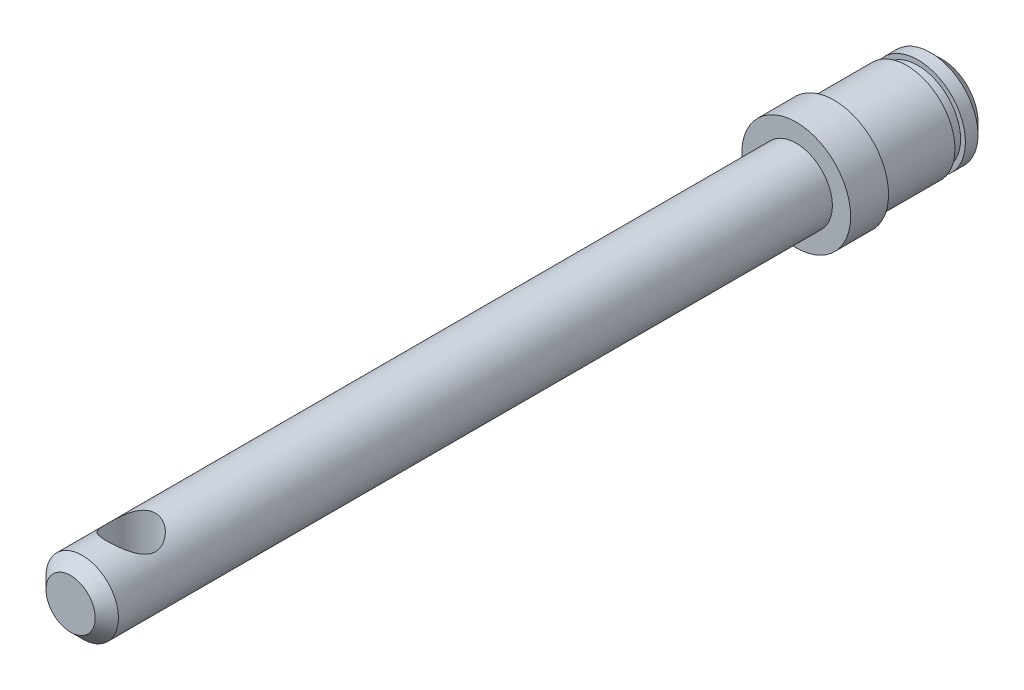
ISO-10303-21;
HEADER;
FILE_DESCRIPTION(('STEP AP214'),'2;1');
FILE_NAME('part.step','',(''),(''),'','','');
FILE_SCHEMA(('AUTOMOTIVE_DESIGN { 1 0 10303 214 1 1 1 1 }'));
ENDSEC;
DATA;
#1=APPLICATION_CONTEXT('core data for automotive mechanical design processes');
#2=APPLICATION_PROTOCOL_DEFINITION('international standard','automotive_design',2000,#1);
#3=PRODUCT_CONTEXT('',#1,'mechanical');
#4=PRODUCT('Part','Part','',(#3));
#5=PRODUCT_RELATED_PRODUCT_CATEGORY('part','',(#4));
#6=PRODUCT_DEFINITION_FORMATION('','',#4);
#7=PRODUCT_DEFINITION_CONTEXT('part definition',#1,'design');
#8=PRODUCT_DEFINITION('design','',#6,#7);
#9=PRODUCT_DEFINITION_SHAPE('','',#8);
#10=(LENGTH_UNIT() NAMED_UNIT(*) SI_UNIT(.MILLI.,.METRE.));
#11=(NAMED_UNIT(*) PLANE_ANGLE_UNIT() SI_UNIT($,.RADIAN.));
#12=(NAMED_UNIT(*) SI_UNIT($,.STERADIAN.) SOLID_ANGLE_UNIT());
#13=UNCERTAINTY_MEASURE_WITH_UNIT(LENGTH_MEASURE(1.E-05),#10,'distance_accuracy_value','');
#14=(GEOMETRIC_REPRESENTATION_CONTEXT(3) GLOBAL_UNCERTAINTY_ASSIGNED_CONTEXT((#13)) GLOBAL_UNIT_ASSIGNED_CONTEXT((#10,
#11,#12)) REPRESENTATION_CONTEXT('',''));
#15=CARTESIAN_POINT('',(0.,0.,0.));
#16=DIRECTION('',(0.,0.,1.));
#17=DIRECTION('',(1.,0.,0.));
#18=AXIS2_PLACEMENT_3D('',#15,#16,#17);
#19=CARTESIAN_POINT('',(0.,0.,-9.5758));
#20=DIRECTION('',(0.,0.,-1.));
#21=DIRECTION('',(-1.,0.,0.));
#22=AXIS2_PLACEMENT_3D('',#19,#20,#21);
#23=PLANE('',#22);
#24=CARTESIAN_POINT('',(0.,0.,-9.57579999993641));
#25=DIRECTION('',(0.,0.,1.));
#26=DIRECTION('',(1.,0.,0.));
#27=AXIS2_PLACEMENT_3D('',#24,#25,#26);
#28=CIRCLE('',#27,2.3494999999798);
#29=CARTESIAN_POINT('',(2.3494999999798,0.,-9.57579999993641));
#30=VERTEX_POINT('',#29);
#31=EDGE_CURVE('E18',#30,#30,#28,.T.);
#32=ORIENTED_EDGE('',*,*,#31,.F.);
#33=EDGE_LOOP('',(#32));
#34=FACE_BOUND('',#33,.T.);
#35=ADVANCED_FACE('F15',(#34),#23,.T.);
#36=CARTESIAN_POINT('',(0.,0.,-8.81380000009813));
#37=DIRECTION('',(0.,0.,1.));
#38=DIRECTION('',(1.,0.,0.));
#39=AXIS2_PLACEMENT_3D('',#36,#37,#38);
#40=CONICAL_SURFACE('',#39,3.11149999987492,0.785398163434747);
#41=ORIENTED_EDGE('',*,*,#31,.T.);
#42=EDGE_LOOP('',(#41));
#43=FACE_BOUND('',#42,.T.);
#44=CARTESIAN_POINT('',(0.,0.,-8.8138));
#45=DIRECTION('',(0.,0.,1.));
#46=DIRECTION('',(1.,0.,0.));
#47=AXIS2_PLACEMENT_3D('',#44,#45,#46);
#48=CIRCLE('',#47,3.1115);
#49=CARTESIAN_POINT('',(3.1115,0.,-8.8138));
#50=VERTEX_POINT('',#49);
#51=EDGE_CURVE('E35',#50,#50,#48,.T.);
#52=ORIENTED_EDGE('',*,*,#51,.F.);
#53=EDGE_LOOP('',(#52));
#54=FACE_BOUND('',#53,.T.);
#55=ADVANCED_FACE('F82',(#43,#54),#40,.T.);
#56=CARTESIAN_POINT('',(0.,0.,-9.5758));
#57=DIRECTION('',(0.,0.,1.));
#58=DIRECTION('',(1.,0.,0.));
#59=AXIS2_PLACEMENT_3D('',#56,#57,#58);
#60=CYLINDRICAL_SURFACE('',#59,3.1115);
#61=ORIENTED_EDGE('',*,*,#51,.T.);
#62=EDGE_LOOP('',(#61));
#63=FACE_BOUND('',#62,.T.);
#64=CARTESIAN_POINT('',(0.,0.,-7.9883));
#65=DIRECTION('',(0.,0.,1.));
#66=DIRECTION('',(1.,0.,0.));
#67=AXIS2_PLACEMENT_3D('',#64,#65,#66);
#68=CIRCLE('',#67,3.1115);
#69=CARTESIAN_POINT('',(3.1115,0.,-7.9883));
#70=VERTEX_POINT('',#69);
#71=EDGE_CURVE('E72',#70,#70,#68,.F.);
#72=ORIENTED_EDGE('',*,*,#71,.T.);
#73=EDGE_LOOP('',(#72));
#74=FACE_BOUND('',#73,.T.);
#75=ADVANCED_FACE('F90',(#63,#74),#60,.T.);
#76=CARTESIAN_POINT('',(0.,0.,-7.9883));
#77=DIRECTION('',(0.,0.,-1.));
#78=DIRECTION('',(-1.,0.,0.));
#79=AXIS2_PLACEMENT_3D('',#76,#77,#78);
#80=PLANE('',#79);
#81=CARTESIAN_POINT('',(0.,0.,-7.9883));
#82=DIRECTION('',(0.,0.,1.));
#83=DIRECTION('',(1.,0.,0.));
#84=AXIS2_PLACEMENT_3D('',#81,#82,#83);
#85=CIRCLE('',#84,2.794);
#86=CARTESIAN_POINT('',(2.794,0.,-7.9883));
#87=VERTEX_POINT('',#86);
#88=EDGE_CURVE('E70',#87,#87,#85,.T.);
#89=ORIENTED_EDGE('',*,*,#88,.F.);
#90=EDGE_LOOP('',(#89));
#91=FACE_BOUND('',#90,.T.);
#92=ORIENTED_EDGE('',*,*,#71,.F.);
#93=EDGE_LOOP('',(#92));
#94=FACE_BOUND('',#93,.T.);
#95=ADVANCED_FACE('F94',(#91,#94),#80,.F.);
#96=CARTESIAN_POINT('',(0.,0.,-7.9883));
#97=DIRECTION('',(0.,0.,1.));
#98=DIRECTION('',(1.,0.,0.));
#99=AXIS2_PLACEMENT_3D('',#96,#97,#98);
#100=CYLINDRICAL_SURFACE('',#99,2.794);
#101=CARTESIAN_POINT('',(0.,0.,-7.2517));
#102=DIRECTION('',(0.,0.,1.));
#103=DIRECTION('',(1.,0.,0.));
#104=AXIS2_PLACEMENT_3D('',#101,#102,#103);
#105=CIRCLE('',#104,2.794);
#106=CARTESIAN_POINT('',(2.794,0.,-7.2517));
#107=VERTEX_POINT('',#106);
#108=EDGE_CURVE('E67',#107,#107,#105,.T.);
#109=ORIENTED_EDGE('',*,*,#108,.F.);
#110=EDGE_LOOP('',(#109));
#111=FACE_BOUND('',#110,.T.);
#112=ORIENTED_EDGE('',*,*,#88,.T.);
#113=EDGE_LOOP('',(#112));
#114=FACE_BOUND('',#113,.T.);
#115=ADVANCED_FACE('F99',(#111,#114),#100,.T.);
#116=CARTESIAN_POINT('',(0.,0.,-7.2517));
#117=DIRECTION('',(0.,0.,-1.));
#118=DIRECTION('',(-1.,0.,0.));
#119=AXIS2_PLACEMENT_3D('',#116,#117,#118);
#120=PLANE('',#119);
#121=ORIENTED_EDGE('',*,*,#108,.T.);
#122=EDGE_LOOP('',(#121));
#123=FACE_BOUND('',#122,.T.);
#124=CARTESIAN_POINT('',(0.,0.,-7.2517));
#125=DIRECTION('',(0.,0.,1.));
#126=DIRECTION('',(1.,0.,0.));
#127=AXIS2_PLACEMENT_3D('',#124,#125,#126);
#128=CIRCLE('',#127,3.1623);
#129=CARTESIAN_POINT('',(3.1623,0.,-7.2517));
#130=VERTEX_POINT('',#129);
#131=EDGE_CURVE('E64',#130,#130,#128,.T.);
#132=ORIENTED_EDGE('',*,*,#131,.F.);
#133=EDGE_LOOP('',(#132));
#134=FACE_BOUND('',#133,.T.);
#135=ADVANCED_FACE('F103',(#123,#134),#120,.T.);
#136=CARTESIAN_POINT('',(0.,0.,-7.2517));
#137=DIRECTION('',(0.,0.,1.));
#138=DIRECTION('',(1.,0.,0.));
#139=AXIS2_PLACEMENT_3D('',#136,#137,#138);
#140=CYLINDRICAL_SURFACE('',#139,3.1623);
#141=ORIENTED_EDGE('',*,*,#131,.T.);
#142=EDGE_LOOP('',(#141));
#143=FACE_BOUND('',#142,.T.);
#144=CARTESIAN_POINT('',(0.,0.,-2.4892));
#145=DIRECTION('',(0.,0.,1.));
#146=DIRECTION('',(1.,0.,0.));
#147=AXIS2_PLACEMENT_3D('',#144,#145,#146);
#148=CIRCLE('',#147,3.1623);
#149=CARTESIAN_POINT('',(3.1623,0.,-2.4892));
#150=VERTEX_POINT('',#149);
#151=EDGE_CURVE('E61',#150,#150,#148,.F.);
#152=ORIENTED_EDGE('',*,*,#151,.T.);
#153=EDGE_LOOP('',(#152));
#154=FACE_BOUND('',#153,.T.);
#155=ADVANCED_FACE('F107',(#143,#154),#140,.T.);
#156=CARTESIAN_POINT('',(0.,0.,-2.4892));
#157=DIRECTION('',(0.,0.,1.));
#158=DIRECTION('',(1.,0.,0.));
#159=AXIS2_PLACEMENT_3D('',#156,#157,#158);
#160=PLANE('',#159);
#161=ORIENTED_EDGE('',*,*,#151,.F.);
#162=EDGE_LOOP('',(#161));
#163=FACE_BOUND('',#162,.T.);
#164=CARTESIAN_POINT('',(0.,0.,-2.4892));
#165=DIRECTION('',(0.,0.,1.));
#166=DIRECTION('',(1.,0.,0.));
#167=AXIS2_PLACEMENT_3D('',#164,#165,#166);
#168=CIRCLE('',#167,3.571875);
#169=CARTESIAN_POINT('',(3.571875,0.,-2.4892));
#170=VERTEX_POINT('',#169);
#171=EDGE_CURVE('E58',#170,#170,#168,.T.);
#172=ORIENTED_EDGE('',*,*,#171,.F.);
#173=EDGE_LOOP('',(#172));
#174=FACE_BOUND('',#173,.T.);
#175=ADVANCED_FACE('F111',(#163,#174),#160,.F.);
#176=CARTESIAN_POINT('',(0.,0.,47.5742));
#177=DIRECTION('',(0.,0.,1.));
#178=DIRECTION('',(1.,0.,0.));
#179=AXIS2_PLACEMENT_3D('',#176,#177,#178);
#180=PLANE('',#179);
#181=CARTESIAN_POINT('',(0.,0.,47.5741999999855));
#182=DIRECTION('',(0.,0.,-1.));
#183=DIRECTION('',(-1.,0.,0.));
#184=AXIS2_PLACEMENT_3D('',#181,#182,#183);
#185=CIRCLE('',#184,1.61289999999781);
#186=CARTESIAN_POINT('',(-1.61289999999781,0.,47.5741999999855));
#187=VERTEX_POINT('',#186);
#188=EDGE_CURVE('E55',#187,#187,#185,.T.);
#189=ORIENTED_EDGE('',*,*,#188,.F.);
#190=EDGE_LOOP('',(#189));
#191=FACE_BOUND('',#190,.T.);
#192=ADVANCED_FACE('F115',(#191),#180,.T.);
#193=CARTESIAN_POINT('',(0.,0.,-2.4892));
#194=DIRECTION('',(0.,0.,1.));
#195=DIRECTION('',(1.,0.,0.));
#196=AXIS2_PLACEMENT_3D('',#193,#194,#195);
#197=CYLINDRICAL_SURFACE('',#196,3.571875);
#198=ORIENTED_EDGE('',*,*,#171,.T.);
#199=EDGE_LOOP('',(#198));
#200=FACE_BOUND('',#199,.T.);
#201=CARTESIAN_POINT('',(0.,0.,0.));
#202=DIRECTION('',(0.,0.,1.));
#203=DIRECTION('',(1.,0.,0.));
#204=AXIS2_PLACEMENT_3D('',#201,#202,#203);
#205=CIRCLE('',#204,3.571875);
#206=CARTESIAN_POINT('',(3.571875,0.,0.));
#207=VERTEX_POINT('',#206);
#208=EDGE_CURVE('E52',#207,#207,#205,.T.);
#209=ORIENTED_EDGE('',*,*,#208,.F.);
#210=EDGE_LOOP('',(#209));
#211=FACE_BOUND('',#210,.T.);
#212=ADVANCED_FACE('F119',(#200,#211),#197,.T.);
#213=CARTESIAN_POINT('',(0.,0.,46.8121999999767));
#214=DIRECTION('',(0.,0.,-1.));
#215=DIRECTION('',(-1.,0.,0.));
#216=AXIS2_PLACEMENT_3D('',#213,#214,#215);
#217=CONICAL_SURFACE('',#216,2.37490000000662,0.785398163397448);
#218=ORIENTED_EDGE('',*,*,#188,.T.);
#219=EDGE_LOOP('',(#218));
#220=FACE_BOUND('',#219,.T.);
#221=CARTESIAN_POINT('',(0.,0.,46.8122));
#222=DIRECTION('',(0.,0.,-1.));
#223=DIRECTION('',(-1.,0.,0.));
#224=AXIS2_PLACEMENT_3D('',#221,#222,#223);
#225=CIRCLE('',#224,2.3749);
#226=CARTESIAN_POINT('',(-2.3749,0.,46.8122));
#227=VERTEX_POINT('',#226);
#228=EDGE_CURVE('E27',#227,#227,#225,.T.);
#229=ORIENTED_EDGE('',*,*,#228,.F.);
#230=EDGE_LOOP('',(#229));
#231=FACE_BOUND('',#230,.T.);
#232=ADVANCED_FACE('F123',(#220,#231),#217,.T.);
#233=CARTESIAN_POINT('',(0.,0.,0.));
#234=DIRECTION('',(0.,0.,1.));
#235=DIRECTION('',(1.,0.,0.));
#236=AXIS2_PLACEMENT_3D('',#233,#234,#235);
#237=PLANE('',#236);
#238=CARTESIAN_POINT('',(0.,0.,0.));
#239=DIRECTION('',(0.,0.,-1.));
#240=DIRECTION('',(-1.,0.,0.));
#241=AXIS2_PLACEMENT_3D('',#238,#239,#240);
#242=CIRCLE('',#241,2.3749);
#243=CARTESIAN_POINT('',(-2.3749,0.,0.));
#244=VERTEX_POINT('',#243);
#245=EDGE_CURVE('E22',#244,#244,#242,.F.);
#246=ORIENTED_EDGE('',*,*,#245,.F.);
#247=EDGE_LOOP('',(#246));
#248=FACE_BOUND('',#247,.T.);
#249=ORIENTED_EDGE('',*,*,#208,.T.);
#250=EDGE_LOOP('',(#249));
#251=FACE_BOUND('',#250,.T.);
#252=ADVANCED_FACE('F126',(#248,#251),#237,.T.);
#253=CARTESIAN_POINT('',(0.,-3.571875,43.60545));
#254=DIRECTION('',(0.,1.,0.));
#255=DIRECTION('',(0.,0.,1.));
#256=AXIS2_PLACEMENT_3D('',#253,#254,#255);
#257=CYLINDRICAL_SURFACE('',#256,1.5875);
#258=CARTESIAN_POINT('',(0.,2.3749,45.19295));
#259=CARTESIAN_POINT('',(-0.0796285021727966,2.37489427166207,45.1929439134093));
#260=CARTESIAN_POINT('',(-0.159333187346092,2.3708547437601,45.1869178453679));
#261=CARTESIAN_POINT('',(-0.316246788253907,2.35507625489168,45.1631617849446));
#262=CARTESIAN_POINT('',(-0.393451638249593,2.34332535323937,45.1454136412255));
#263=CARTESIAN_POINT('',(-0.542790518515763,2.31328830758023,45.0993083312295));
#264=CARTESIAN_POINT('',(-0.614948378456795,2.29503576257873,45.0710056736267));
#265=CARTESIAN_POINT('',(-0.753178545236462,2.25346165524091,45.0050040485006));
#266=CARTESIAN_POINT('',(-0.819251194999285,2.23014037879558,44.9673056109087));
#267=CARTESIAN_POINT('',(-0.949807131451189,2.17792784028168,44.8800881288627));
#268=CARTESIAN_POINT('',(-1.01367601133952,2.14873138397025,44.8298358883516));
#269=CARTESIAN_POINT('',(-1.13266066753279,2.0884656766868,44.7206931180195));
#270=CARTESIAN_POINT('',(-1.18776336726205,2.05739372150985,44.6617899306125));
#271=CARTESIAN_POINT('',(-1.29659427145063,1.99089626995362,44.5261680967343));
#272=CARTESIAN_POINT('',(-1.34871636553572,1.95556248733199,44.4481056626616));
#273=CARTESIAN_POINT('',(-1.43904349853149,1.89008374794265,44.2823403381314));
#274=CARTESIAN_POINT('',(-1.4772725865024,1.85992987284409,44.1946544520516));
#275=CARTESIAN_POINT('',(-1.52904517834333,1.81740283377534,44.0377472795276));
#276=CARTESIAN_POINT('',(-1.54653236351236,1.80240921282223,43.9705447171603));
#277=CARTESIAN_POINT('',(-1.57261168441343,1.77970474695812,43.8332848433952));
#278=CARTESIAN_POINT('',(-1.58121930044462,1.7719812296935,43.763232722255));
#279=CARTESIAN_POINT('',(-1.58899802612375,1.76501215254764,43.6218716388384));
#280=CARTESIAN_POINT('',(-1.58812985724121,1.76580188116326,43.5505586693621));
#281=CARTESIAN_POINT('',(-1.57692650593038,1.77581049841768,43.4092572197684));
#282=CARTESIAN_POINT('',(-1.56658327442516,1.7850365537139,43.3392699174096));
#283=CARTESIAN_POINT('',(-1.53778680769931,1.80988877384798,43.2056567626746));
#284=CARTESIAN_POINT('',(-1.51972103829905,1.82520699487101,43.1418863605764));
#285=CARTESIAN_POINT('',(-1.47635800673587,1.86045582345457,43.0182351850859));
#286=CARTESIAN_POINT('',(-1.45105836975688,1.88038794530891,42.9583556969829));
#287=CARTESIAN_POINT('',(-1.38804369169894,1.92751840139636,42.8311724358925));
#288=CARTESIAN_POINT('',(-1.34884877883874,1.95536954816995,42.7648460457442));
#289=CARTESIAN_POINT('',(-1.26169992826936,2.01270750683002,42.6389401049234));
#290=CARTESIAN_POINT('',(-1.21373539144903,2.04219626760565,42.5793688613398));
#291=CARTESIAN_POINT('',(-1.09822042057742,2.10697571698643,42.4553504562286));
#292=CARTESIAN_POINT('',(-1.02867941502371,2.14213147691545,42.3926663982129));
#293=CARTESIAN_POINT('',(-0.87829590652397,2.20804612806214,42.2797162875604));
#294=CARTESIAN_POINT('',(-0.797461070213304,2.23880797360637,42.2294418743602));
#295=CARTESIAN_POINT('',(-0.642794196366182,2.28740091649053,42.151857840345));
#296=CARTESIAN_POINT('',(-0.570673934887535,2.30658392602361,42.1219812810788));
#297=CARTESIAN_POINT('',(-0.421590346714549,2.33841465201831,42.0729550712348));
#298=CARTESIAN_POINT('',(-0.344638477425361,2.35107721947041,42.05378103609));
#299=CARTESIAN_POINT('',(-0.222529004084351,2.36486476954346,42.0329936390966));
#300=CARTESIAN_POINT('',(-0.178308116016056,2.36861511899109,42.0273651451537));
#301=CARTESIAN_POINT('',(-0.0893995612791168,2.37363462559172,42.0198411908061));
#302=CARTESIAN_POINT('',(-0.0447117904210668,2.37490321648955,42.0179465823498));
#303=CARTESIAN_POINT('',(0.0796285021727959,2.37489427166207,42.0179560865907));
#304=CARTESIAN_POINT('',(0.159333187346092,2.3708547437601,42.0239821546321));
#305=CARTESIAN_POINT('',(0.316246788253906,2.35507625489168,42.0477382150553));
#306=CARTESIAN_POINT('',(0.393451638249593,2.34332535323937,42.0654863587745));
#307=CARTESIAN_POINT('',(0.542790518515763,2.31328830758023,42.1115916687705));
#308=CARTESIAN_POINT('',(0.614948378456795,2.29503576257873,42.1398943263733));
#309=CARTESIAN_POINT('',(0.753178545236463,2.25346165524091,42.2058959514994));
#310=CARTESIAN_POINT('',(0.819251194999285,2.23014037879558,42.2435943890913));
#311=CARTESIAN_POINT('',(0.949807131451189,2.17792784028168,42.3308118711373));
#312=CARTESIAN_POINT('',(1.01367601133952,2.14873138397025,42.3810641116484));
#313=CARTESIAN_POINT('',(1.13266066753279,2.0884656766868,42.4902068819805));
#314=CARTESIAN_POINT('',(1.18776336726205,2.05739372150985,42.5491100693874));
#315=CARTESIAN_POINT('',(1.29659427145063,1.99089626995362,42.6847319032657));
#316=CARTESIAN_POINT('',(1.34871636553572,1.95556248733199,42.7627943373384));
#317=CARTESIAN_POINT('',(1.43904349853149,1.89008374794265,42.9285596618686));
#318=CARTESIAN_POINT('',(1.4772725865024,1.85992987284409,43.0162455479484));
#319=CARTESIAN_POINT('',(1.52904517834333,1.81740283377534,43.1731527204724));
#320=CARTESIAN_POINT('',(1.54653236351236,1.80240921282223,43.2403552828397));
#321=CARTESIAN_POINT('',(1.57261168441343,1.77970474695812,43.3776151566048));
#322=CARTESIAN_POINT('',(1.58121930044462,1.7719812296935,43.447667277745));
#323=CARTESIAN_POINT('',(1.58899802612375,1.76501215254764,43.5890283611616));
#324=CARTESIAN_POINT('',(1.58812985724121,1.76580188116326,43.6603413306379));
#325=CARTESIAN_POINT('',(1.57692650593038,1.77581049841768,43.8016427802316));
#326=CARTESIAN_POINT('',(1.56658327442517,1.7850365537139,43.8716300825904));
#327=CARTESIAN_POINT('',(1.53778680769931,1.80988877384798,44.0052432373254));
#328=CARTESIAN_POINT('',(1.51972103829905,1.825206994871,44.0690136394236));
#329=CARTESIAN_POINT('',(1.47635800673587,1.86045582345457,44.192664814914));
#330=CARTESIAN_POINT('',(1.45105836975689,1.88038794530891,44.2525443030171));
#331=CARTESIAN_POINT('',(1.38804369169894,1.92751840139636,44.3797275641075));
#332=CARTESIAN_POINT('',(1.34884877883874,1.95536954816995,44.4460539542558));
#333=CARTESIAN_POINT('',(1.26169992826936,2.01270750683002,44.5719598950766));
#334=CARTESIAN_POINT('',(1.21373539144903,2.04219626760564,44.6315311386602));
#335=CARTESIAN_POINT('',(1.09822042057742,2.10697571698643,44.7555495437714));
#336=CARTESIAN_POINT('',(1.02867941502371,2.14213147691544,44.8182336017871));
#337=CARTESIAN_POINT('',(0.87829590652398,2.20804612806214,44.9311837124396));
#338=CARTESIAN_POINT('',(0.797461070213316,2.23880797360636,44.9814581256398));
#339=CARTESIAN_POINT('',(0.642794196366197,2.28740091649053,45.059042159655));
#340=CARTESIAN_POINT('',(0.57067393488755,2.30658392602361,45.0889187189212));
#341=CARTESIAN_POINT('',(0.421590346714565,2.33841465201831,45.1379449287651));
#342=CARTESIAN_POINT('',(0.344638477425378,2.3510772194704,45.15711896391));
#343=CARTESIAN_POINT('',(0.222529004084365,2.36486476954346,45.1779063609034));
#344=CARTESIAN_POINT('',(0.178308116016067,2.36861511899109,45.1835348548463));
#345=CARTESIAN_POINT('',(0.0893995612791212,2.37363462559172,45.1910588091939));
#346=CARTESIAN_POINT('',(0.0447117904210687,2.37490321648955,45.1929534176502));
#347=CARTESIAN_POINT('',(0.,2.3749,45.19295));
#348=B_SPLINE_CURVE_WITH_KNOTS('',3,(#258,#259,#260,#261,#262,#263,#264,#265,#266,#267,#268,
#269,#270,#271,#272,#273,#274,#275,#276,#277,#278,#279,#280,#281,#282,#283,#284,#285,#286,#287,
#288,#289,#290,#291,#292,#293,#294,#295,#296,#297,#298,#299,#300,#301,#302,#303,#304,#305,#306,
#307,#308,#309,#310,#311,#312,#313,#314,#315,#316,#317,#318,#319,#320,#321,#322,#323,#324,#325,
#326,#327,#328,#329,#330,#331,#332,#333,#334,#335,#336,#337,#338,#339,#340,#341,#342,#343,#344,
#345,#346,#347),.UNSPECIFIED.,.T.,.F.,(4,2,2,2,2,2,2,2,2,2,2,2,2,2,2,2,2,2,2,2,2,2,2,2,2,2,2,2,
2,2,2,2,2,2,2,2,2,2,2,2,2,2,2,2,4),(0.,0.238700395852421,0.477771282535445,0.71562421428543,
0.95346373392742,1.21155549797826,1.47002872073382,1.76952408912618,2.06849852769238,
2.28077891750231,2.49268859719911,2.70547700634111,2.9184463472867,3.12179507761272,
3.32521064236503,3.57012288877609,3.815333120713,4.1139409115089,4.41234697329097,
4.65252034508975,4.89214425005817,5.02614510978654,5.16017654051243,5.39887693636485,
5.63794782304788,5.87580075479786,6.11364027443985,6.37173203849069,6.63020526124625,
6.92970062963861,7.22867506820481,7.44095545801474,7.65286513771153,7.86565354685354,
8.07862288779913,8.28197161812515,8.48538718287745,8.73029942928851,8.97550966122542,
9.27411745202132,9.57252351380338,9.81269688560216,10.0523207905706,10.186321650299,
10.3203530810249),.UNSPECIFIED.);
#349=CARTESIAN_POINT('',(0.,2.3749,45.19295));
#350=VERTEX_POINT('',#349);
#351=EDGE_CURVE('E46',#350,#350,#348,.T.);
#352=ORIENTED_EDGE('',*,*,#351,.F.);
#353=EDGE_LOOP('',(#352));
#354=FACE_BOUND('',#353,.T.);
#355=CARTESIAN_POINT('',(0.,-2.3749,45.19295));
#356=CARTESIAN_POINT('',(0.079628502172797,-2.37489427166208,45.1929439134093));
#357=CARTESIAN_POINT('',(0.159333187346093,-2.3708547437601,45.1869178453679));
#358=CARTESIAN_POINT('',(0.316246788253907,-2.35507625489168,45.1631617849446));
#359=CARTESIAN_POINT('',(0.393451638249594,-2.34332535323937,45.1454136412255));
#360=CARTESIAN_POINT('',(0.542790518515763,-2.31328830758023,45.0993083312295));
#361=CARTESIAN_POINT('',(0.614948378456796,-2.29503576257873,45.0710056736267));
#362=CARTESIAN_POINT('',(0.753178545236462,-2.25346165524091,45.0050040485006));
#363=CARTESIAN_POINT('',(0.819251194999285,-2.23014037879558,44.9673056109087));
#364=CARTESIAN_POINT('',(0.949807131451189,-2.17792784028168,44.8800881288627));
#365=CARTESIAN_POINT('',(1.01367601133952,-2.14873138397025,44.8298358883516));
#366=CARTESIAN_POINT('',(1.13266066753279,-2.0884656766868,44.7206931180195));
#367=CARTESIAN_POINT('',(1.18776336726205,-2.05739372150985,44.6617899306125));
#368=CARTESIAN_POINT('',(1.29659427145063,-1.99089626995362,44.5261680967343));
#369=CARTESIAN_POINT('',(1.34871636553572,-1.95556248733199,44.4481056626616));
#370=CARTESIAN_POINT('',(1.43904349853149,-1.89008374794265,44.2823403381314));
#371=CARTESIAN_POINT('',(1.4772725865024,-1.85992987284409,44.1946544520516));
#372=CARTESIAN_POINT('',(1.52904517834333,-1.81740283377534,44.0377472795276));
#373=CARTESIAN_POINT('',(1.54653236351237,-1.80240921282223,43.9705447171602));
#374=CARTESIAN_POINT('',(1.57261168441344,-1.77970474695812,43.8332848433952));
#375=CARTESIAN_POINT('',(1.58121930044462,-1.7719812296935,43.763232722255));
#376=CARTESIAN_POINT('',(1.58899802612375,-1.76501215254764,43.6218716388384));
#377=CARTESIAN_POINT('',(1.58812985724121,-1.76580188116326,43.5505586693621));
#378=CARTESIAN_POINT('',(1.57692650593038,-1.77581049841768,43.4092572197684));
#379=CARTESIAN_POINT('',(1.56658327442516,-1.7850365537139,43.3392699174096));
#380=CARTESIAN_POINT('',(1.53778680769931,-1.80988877384798,43.2056567626746));
#381=CARTESIAN_POINT('',(1.51972103829905,-1.82520699487101,43.1418863605764));
#382=CARTESIAN_POINT('',(1.47635800673587,-1.86045582345457,43.0182351850859));
#383=CARTESIAN_POINT('',(1.45105836975688,-1.88038794530891,42.9583556969829));
#384=CARTESIAN_POINT('',(1.38804369169894,-1.92751840139636,42.8311724358925));
#385=CARTESIAN_POINT('',(1.34884877883874,-1.95536954816995,42.7648460457442));
#386=CARTESIAN_POINT('',(1.26169992826936,-2.01270750683002,42.6389401049234));
#387=CARTESIAN_POINT('',(1.21373539144903,-2.04219626760565,42.5793688613398));
#388=CARTESIAN_POINT('',(1.09822042057742,-2.10697571698643,42.4553504562286));
#389=CARTESIAN_POINT('',(1.0286794150237,-2.14213147691545,42.3926663982129));
#390=CARTESIAN_POINT('',(0.878295906523966,-2.20804612806214,42.2797162875604));
#391=CARTESIAN_POINT('',(0.797461070213302,-2.23880797360637,42.2294418743602));
#392=CARTESIAN_POINT('',(0.642794196366183,-2.28740091649053,42.151857840345));
#393=CARTESIAN_POINT('',(0.570673934887537,-2.30658392602361,42.1219812810788));
#394=CARTESIAN_POINT('',(0.421590346714551,-2.33841465201831,42.0729550712348));
#395=CARTESIAN_POINT('',(0.344638477425362,-2.35107721947041,42.05378103609));
#396=CARTESIAN_POINT('',(0.22252900408435,-2.36486476954346,42.0329936390966));
#397=CARTESIAN_POINT('',(0.178308116016056,-2.36861511899109,42.0273651451537));
#398=CARTESIAN_POINT('',(0.0893995612791169,-2.37363462559172,42.0198411908061));
#399=CARTESIAN_POINT('',(0.0447117904210671,-2.37490321648955,42.0179465823498));
#400=CARTESIAN_POINT('',(-0.0796285021727957,-2.37489427166208,42.0179560865907));
#401=CARTESIAN_POINT('',(-0.159333187346092,-2.3708547437601,42.0239821546321));
#402=CARTESIAN_POINT('',(-0.316246788253906,-2.35507625489168,42.0477382150553));
#403=CARTESIAN_POINT('',(-0.393451638249593,-2.34332535323937,42.0654863587745));
#404=CARTESIAN_POINT('',(-0.542790518515762,-2.31328830758023,42.1115916687705));
#405=CARTESIAN_POINT('',(-0.614948378456795,-2.29503576257873,42.1398943263733));
#406=CARTESIAN_POINT('',(-0.753178545236462,-2.25346165524091,42.2058959514994));
#407=CARTESIAN_POINT('',(-0.819251194999284,-2.23014037879558,42.2435943890913));
#408=CARTESIAN_POINT('',(-0.949807131451189,-2.17792784028168,42.3308118711373));
#409=CARTESIAN_POINT('',(-1.01367601133952,-2.14873138397025,42.3810641116484));
#410=CARTESIAN_POINT('',(-1.13266066753279,-2.0884656766868,42.4902068819805));
#411=CARTESIAN_POINT('',(-1.18776336726205,-2.05739372150985,42.5491100693874));
#412=CARTESIAN_POINT('',(-1.29659427145063,-1.99089626995362,42.6847319032657));
#413=CARTESIAN_POINT('',(-1.34871636553572,-1.95556248733199,42.7627943373384));
#414=CARTESIAN_POINT('',(-1.43904349853149,-1.89008374794265,42.9285596618686));
#415=CARTESIAN_POINT('',(-1.4772725865024,-1.85992987284409,43.0162455479484));
#416=CARTESIAN_POINT('',(-1.52904517834333,-1.81740283377534,43.1731527204724));
#417=CARTESIAN_POINT('',(-1.54653236351237,-1.80240921282223,43.2403552828398));
#418=CARTESIAN_POINT('',(-1.57261168441344,-1.77970474695812,43.3776151566048));
#419=CARTESIAN_POINT('',(-1.58121930044462,-1.7719812296935,43.447667277745));
#420=CARTESIAN_POINT('',(-1.58899802612375,-1.76501215254764,43.5890283611616));
#421=CARTESIAN_POINT('',(-1.58812985724121,-1.76580188116326,43.6603413306379));
#422=CARTESIAN_POINT('',(-1.57692650593038,-1.77581049841768,43.8016427802316));
#423=CARTESIAN_POINT('',(-1.56658327442516,-1.7850365537139,43.8716300825904));
#424=CARTESIAN_POINT('',(-1.53778680769931,-1.80988877384798,44.0052432373254));
#425=CARTESIAN_POINT('',(-1.51972103829905,-1.82520699487101,44.0690136394236));
#426=CARTESIAN_POINT('',(-1.47635800673587,-1.86045582345457,44.192664814914));
#427=CARTESIAN_POINT('',(-1.45105836975688,-1.88038794530891,44.2525443030171));
#428=CARTESIAN_POINT('',(-1.38804369169894,-1.92751840139636,44.3797275641075));
#429=CARTESIAN_POINT('',(-1.34884877883874,-1.95536954816995,44.4460539542558));
#430=CARTESIAN_POINT('',(-1.26169992826936,-2.01270750683002,44.5719598950766));
#431=CARTESIAN_POINT('',(-1.21373539144903,-2.04219626760565,44.6315311386602));
#432=CARTESIAN_POINT('',(-1.09822042057742,-2.10697571698643,44.7555495437714));
#433=CARTESIAN_POINT('',(-1.02867941502371,-2.14213147691544,44.8182336017871));
#434=CARTESIAN_POINT('',(-0.878295906523972,-2.20804612806214,44.9311837124396));
#435=CARTESIAN_POINT('',(-0.797461070213305,-2.23880797360637,44.9814581256398));
#436=CARTESIAN_POINT('',(-0.642794196366183,-2.28740091649053,45.059042159655));
#437=CARTESIAN_POINT('',(-0.570673934887537,-2.30658392602361,45.0889187189212));
#438=CARTESIAN_POINT('',(-0.421590346714551,-2.33841465201831,45.1379449287651));
#439=CARTESIAN_POINT('',(-0.344638477425362,-2.35107721947041,45.15711896391));
#440=CARTESIAN_POINT('',(-0.22252900408435,-2.36486476954346,45.1779063609034));
#441=CARTESIAN_POINT('',(-0.178308116016055,-2.36861511899109,45.1835348548463));
#442=CARTESIAN_POINT('',(-0.0893995612791154,-2.37363462559172,45.1910588091939));
#443=CARTESIAN_POINT('',(-0.0447117904210655,-2.37490321648955,45.1929534176502));
#444=CARTESIAN_POINT('',(0.,-2.3749,45.19295));
#445=B_SPLINE_CURVE_WITH_KNOTS('',3,(#355,#356,#357,#358,#359,#360,#361,#362,#363,#364,#365,
#366,#367,#368,#369,#370,#371,#372,#373,#374,#375,#376,#377,#378,#379,#380,#381,#382,#383,#384,
#385,#386,#387,#388,#389,#390,#391,#392,#393,#394,#395,#396,#397,#398,#399,#400,#401,#402,#403,
#404,#405,#406,#407,#408,#409,#410,#411,#412,#413,#414,#415,#416,#417,#418,#419,#420,#421,#422,
#423,#424,#425,#426,#427,#428,#429,#430,#431,#432,#433,#434,#435,#436,#437,#438,#439,#440,#441,
#442,#443,#444),.UNSPECIFIED.,.T.,.F.,(4,2,2,2,2,2,2,2,2,2,2,2,2,2,2,2,2,2,2,2,2,2,2,2,2,2,2,2,
2,2,2,2,2,2,2,2,2,2,2,2,2,2,2,2,4),(0.,0.238700395852421,0.477771282535445,0.71562421428543,
0.953463733927419,1.21155549797826,1.47002872073382,1.76952408912618,2.06849852769238,
2.28077891750232,2.49268859719911,2.70547700634111,2.9184463472867,3.12179507761272,
3.32521064236503,3.57012288877609,3.815333120713,4.11394091150891,4.41234697329097,
4.65252034508974,4.89214425005817,5.02614510978654,5.16017654051243,5.39887693636485,
5.63794782304788,5.87580075479786,6.11364027443985,6.37173203849069,6.63020526124625,
6.92970062963861,7.22867506820481,7.44095545801475,7.65286513771154,7.86565354685354,
8.07862288779913,8.28197161812515,8.48538718287746,8.73029942928852,8.97550966122543,
9.27411745202133,9.5725235138034,9.81269688560218,10.0523207905706,10.186321650299,
10.3203530810249),.UNSPECIFIED.);
#446=CARTESIAN_POINT('',(0.,-2.3749,45.19295));
#447=VERTEX_POINT('',#446);
#448=EDGE_CURVE('E10',#447,#447,#445,.T.);
#449=ORIENTED_EDGE('',*,*,#448,.F.);
#450=EDGE_LOOP('',(#449));
#451=FACE_BOUND('',#450,.T.);
#452=ADVANCED_FACE('F38',(#354,#451),#257,.F.);
#453=CARTESIAN_POINT('',(0.,0.,47.5742));
#454=DIRECTION('',(0.,0.,-1.));
#455=DIRECTION('',(-1.,0.,0.));
#456=AXIS2_PLACEMENT_3D('',#453,#454,#455);
#457=CYLINDRICAL_SURFACE('',#456,2.3749);
#458=ORIENTED_EDGE('',*,*,#228,.T.);
#459=EDGE_LOOP('',(#458));
#460=FACE_BOUND('',#459,.T.);
#461=ORIENTED_EDGE('',*,*,#448,.T.);
#462=EDGE_LOOP('',(#461));
#463=FACE_BOUND('',#462,.T.);
#464=ORIENTED_EDGE('',*,*,#245,.T.);
#465=EDGE_LOOP('',(#464));
#466=FACE_BOUND('',#465,.T.);
#467=ORIENTED_EDGE('',*,*,#351,.T.);
#468=EDGE_LOOP('',(#467));
#469=FACE_BOUND('',#468,.T.);
#470=ADVANCED_FACE('F41',(#460,#463,#466,#469),#457,.T.);
#471=CLOSED_SHELL('',(#35,#55,#75,#95,#115,#135,#155,#175,#192,#212,#232,#252,#452,#470));
#472=MANIFOLD_SOLID_BREP('B1',#471);
#473=ADVANCED_BREP_SHAPE_REPRESENTATION('',(#18,#472),#14);
#474=SHAPE_DEFINITION_REPRESENTATION(#9,#473);
ENDSEC;
END-ISO-10303-21;
